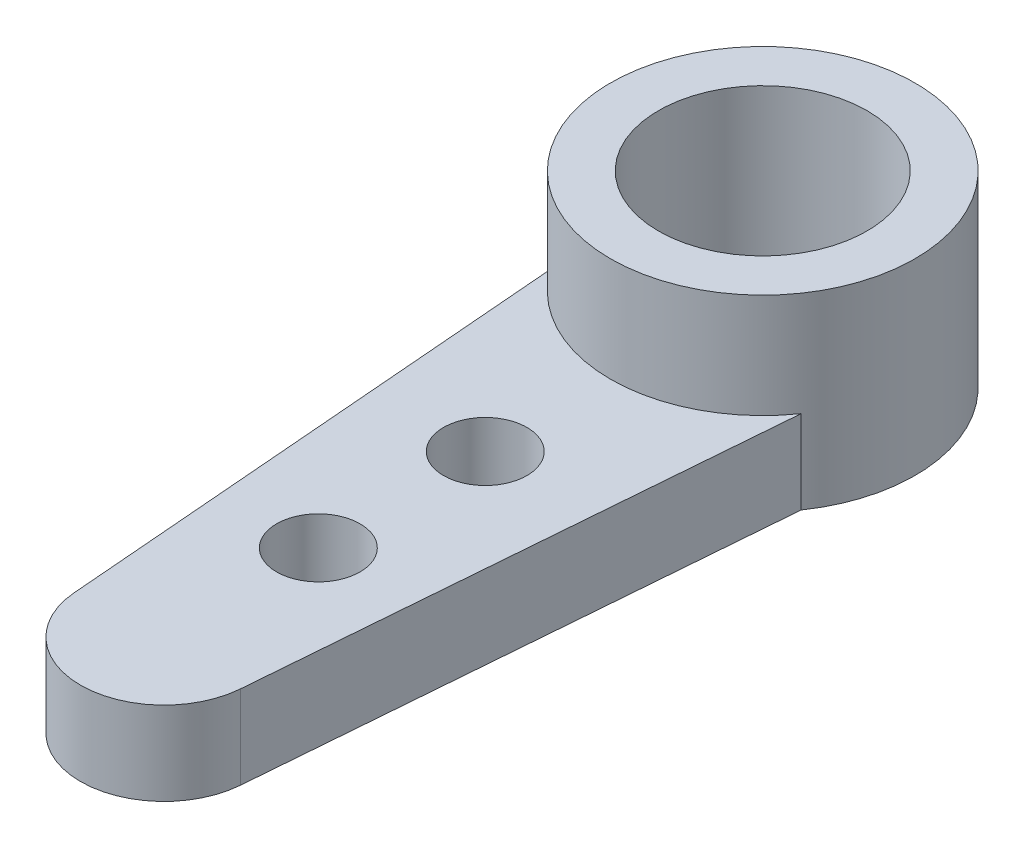
ISO-10303-21;
HEADER;
FILE_DESCRIPTION(('STEP AP214'),'2;1');
FILE_NAME('part.step','',(''),(''),'','','');
FILE_SCHEMA(('AUTOMOTIVE_DESIGN { 1 0 10303 214 1 1 1 1 }'));
ENDSEC;
DATA;
#1=APPLICATION_CONTEXT('core data for automotive mechanical design processes');
#2=APPLICATION_PROTOCOL_DEFINITION('international standard','automotive_design',2000,#1);
#3=PRODUCT_CONTEXT('',#1,'mechanical');
#4=PRODUCT('Part','Part','',(#3));
#5=PRODUCT_RELATED_PRODUCT_CATEGORY('part','',(#4));
#6=PRODUCT_DEFINITION_FORMATION('','',#4);
#7=PRODUCT_DEFINITION_CONTEXT('part definition',#1,'design');
#8=PRODUCT_DEFINITION('design','',#6,#7);
#9=PRODUCT_DEFINITION_SHAPE('','',#8);
#10=(LENGTH_UNIT() NAMED_UNIT(*) SI_UNIT(.MILLI.,.METRE.));
#11=(NAMED_UNIT(*) PLANE_ANGLE_UNIT() SI_UNIT($,.RADIAN.));
#12=(NAMED_UNIT(*) SI_UNIT($,.STERADIAN.) SOLID_ANGLE_UNIT());
#13=UNCERTAINTY_MEASURE_WITH_UNIT(LENGTH_MEASURE(1.E-05),#10,'distance_accuracy_value','');
#14=(GEOMETRIC_REPRESENTATION_CONTEXT(3) GLOBAL_UNCERTAINTY_ASSIGNED_CONTEXT((#13)) GLOBAL_UNIT_ASSIGNED_CONTEXT((#10,
#11,#12)) REPRESENTATION_CONTEXT('',''));
#15=CARTESIAN_POINT('',(0.,0.,0.));
#16=DIRECTION('',(0.,0.,1.));
#17=DIRECTION('',(1.,0.,0.));
#18=AXIS2_PLACEMENT_3D('',#15,#16,#17);
#19=CARTESIAN_POINT('',(0.,2.,0.));
#20=DIRECTION('',(0.,1.,0.));
#21=DIRECTION('',(0.,0.,1.));
#22=AXIS2_PLACEMENT_3D('',#19,#20,#21);
#23=PLANE('',#22);
#24=CARTESIAN_POINT('',(0.,2.,0.));
#25=DIRECTION('',(0.,1.,0.));
#26=DIRECTION('',(0.,0.,1.));
#27=AXIS2_PLACEMENT_3D('',#24,#25,#26);
#28=CIRCLE('',#27,3.65);
#29=CARTESIAN_POINT('',(-3.,2.,2.07906228862918));
#30=VERTEX_POINT('',#29);
#31=CARTESIAN_POINT('',(3.,2.,2.07906228862918));
#32=VERTEX_POINT('',#31);
#33=EDGE_CURVE('E11',#30,#32,#28,.T.);
#34=ORIENTED_EDGE('',*,*,#33,.F.);
#35=DIRECTION('',(0.0806960551621589,0.,0.996738755482732));
#36=VECTOR('',#35,1.);
#37=CARTESIAN_POINT('',(-1.99347751096547,2.,14.5113921103243));
#38=LINE('',#37,#36);
#39=CARTESIAN_POINT('',(-1.99347751096547,2.,14.5113921103243));
#40=VERTEX_POINT('',#39);
#41=EDGE_CURVE('E101',#30,#40,#38,.T.);
#42=ORIENTED_EDGE('',*,*,#41,.T.);
#43=CARTESIAN_POINT('',(0.,2.,14.35));
#44=DIRECTION('',(0.,1.,0.));
#45=DIRECTION('',(0.,0.,-1.));
#46=AXIS2_PLACEMENT_3D('',#43,#44,#45);
#47=CIRCLE('',#46,2.);
#48=CARTESIAN_POINT('',(1.99347751096547,2.,14.5113921103243));
#49=VERTEX_POINT('',#48);
#50=EDGE_CURVE('E52',#40,#49,#47,.T.);
#51=ORIENTED_EDGE('',*,*,#50,.T.);
#52=DIRECTION('',(0.0806960551621589,0.,-0.996738755482732));
#53=VECTOR('',#52,1.);
#54=CARTESIAN_POINT('',(3.,2.,2.07906228862918));
#55=LINE('',#54,#53);
#56=EDGE_CURVE('E83',#49,#32,#55,.T.);
#57=ORIENTED_EDGE('',*,*,#56,.T.);
#58=EDGE_LOOP('',(#34,#42,#51,#57));
#59=FACE_BOUND('',#58,.T.);
#60=CARTESIAN_POINT('',(0.,2.,10.65));
#61=DIRECTION('',(0.,1.,0.));
#62=DIRECTION('',(0.,0.,1.));
#63=AXIS2_PLACEMENT_3D('',#60,#61,#62);
#64=CIRCLE('',#63,1.);
#65=CARTESIAN_POINT('',(0.,2.,11.65));
#66=VERTEX_POINT('',#65);
#67=EDGE_CURVE('E120',#66,#66,#64,.T.);
#68=ORIENTED_EDGE('',*,*,#67,.F.);
#69=EDGE_LOOP('',(#68));
#70=FACE_BOUND('',#69,.T.);
#71=CARTESIAN_POINT('',(0.,2.,6.65));
#72=DIRECTION('',(0.,1.,0.));
#73=DIRECTION('',(0.,0.,1.));
#74=AXIS2_PLACEMENT_3D('',#71,#72,#73);
#75=CIRCLE('',#74,1.);
#76=CARTESIAN_POINT('',(0.,2.,7.65));
#77=VERTEX_POINT('',#76);
#78=EDGE_CURVE('E115',#77,#77,#75,.T.);
#79=ORIENTED_EDGE('',*,*,#78,.F.);
#80=EDGE_LOOP('',(#79));
#81=FACE_BOUND('',#80,.T.);
#82=ADVANCED_FACE('F33',(#59,#70,#81),#23,.T.);
#83=CARTESIAN_POINT('',(0.,0.,0.));
#84=DIRECTION('',(0.,1.,0.));
#85=DIRECTION('',(0.,0.,1.));
#86=AXIS2_PLACEMENT_3D('',#83,#84,#85);
#87=PLANE('',#86);
#88=CARTESIAN_POINT('',(0.,0.,10.65));
#89=DIRECTION('',(0.,1.,0.));
#90=DIRECTION('',(0.,0.,1.));
#91=AXIS2_PLACEMENT_3D('',#88,#89,#90);
#92=CIRCLE('',#91,1.);
#93=CARTESIAN_POINT('',(0.,0.,11.65));
#94=VERTEX_POINT('',#93);
#95=EDGE_CURVE('E123',#94,#94,#92,.T.);
#96=ORIENTED_EDGE('',*,*,#95,.T.);
#97=EDGE_LOOP('',(#96));
#98=FACE_BOUND('',#97,.T.);
#99=CARTESIAN_POINT('',(0.,0.,0.));
#100=DIRECTION('',(0.,1.,0.));
#101=DIRECTION('',(0.,0.,1.));
#102=AXIS2_PLACEMENT_3D('',#99,#100,#101);
#103=CIRCLE('',#102,3.65);
#104=CARTESIAN_POINT('',(3.,0.,2.07906228862918));
#105=VERTEX_POINT('',#104);
#106=CARTESIAN_POINT('',(-3.,0.,2.07906228862918));
#107=VERTEX_POINT('',#106);
#108=EDGE_CURVE('E94',#105,#107,#103,.T.);
#109=ORIENTED_EDGE('',*,*,#108,.F.);
#110=DIRECTION('',(0.0806960551621589,0.,-0.996738755482732));
#111=VECTOR('',#110,1.);
#112=CARTESIAN_POINT('',(3.,0.,2.07906228862918));
#113=LINE('',#112,#111);
#114=CARTESIAN_POINT('',(1.99347751096547,0.,14.5113921103243));
#115=VERTEX_POINT('',#114);
#116=EDGE_CURVE('E75',#115,#105,#113,.T.);
#117=ORIENTED_EDGE('',*,*,#116,.F.);
#118=CARTESIAN_POINT('',(0.,0.,14.35));
#119=DIRECTION('',(0.,1.,0.));
#120=DIRECTION('',(0.,0.,-1.));
#121=AXIS2_PLACEMENT_3D('',#118,#119,#120);
#122=CIRCLE('',#121,2.);
#123=CARTESIAN_POINT('',(-1.99347751096547,0.,14.5113921103243));
#124=VERTEX_POINT('',#123);
#125=EDGE_CURVE('E69',#124,#115,#122,.T.);
#126=ORIENTED_EDGE('',*,*,#125,.F.);
#127=DIRECTION('',(0.0806960551621589,0.,0.996738755482732));
#128=VECTOR('',#127,1.);
#129=CARTESIAN_POINT('',(-1.99347751096547,0.,14.5113921103243));
#130=LINE('',#129,#128);
#131=EDGE_CURVE('E112',#107,#124,#130,.T.);
#132=ORIENTED_EDGE('',*,*,#131,.F.);
#133=EDGE_LOOP('',(#109,#117,#126,#132));
#134=FACE_BOUND('',#133,.T.);
#135=CARTESIAN_POINT('',(0.,0.,6.65));
#136=DIRECTION('',(0.,1.,0.));
#137=DIRECTION('',(0.,0.,1.));
#138=AXIS2_PLACEMENT_3D('',#135,#136,#137);
#139=CIRCLE('',#138,1.);
#140=CARTESIAN_POINT('',(0.,0.,7.65));
#141=VERTEX_POINT('',#140);
#142=EDGE_CURVE('E117',#141,#141,#139,.T.);
#143=ORIENTED_EDGE('',*,*,#142,.T.);
#144=EDGE_LOOP('',(#143));
#145=FACE_BOUND('',#144,.T.);
#146=CARTESIAN_POINT('',(0.,0.,0.));
#147=DIRECTION('',(0.,1.,0.));
#148=DIRECTION('',(0.,0.,1.));
#149=AXIS2_PLACEMENT_3D('',#146,#147,#148);
#150=CIRCLE('',#149,2.5);
#151=CARTESIAN_POINT('',(0.,0.,2.5));
#152=VERTEX_POINT('',#151);
#153=EDGE_CURVE('E126',#152,#152,#150,.T.);
#154=ORIENTED_EDGE('',*,*,#153,.T.);
#155=EDGE_LOOP('',(#154));
#156=FACE_BOUND('',#155,.T.);
#157=ADVANCED_FACE('F151',(#98,#134,#145,#156),#87,.F.);
#158=CARTESIAN_POINT('',(0.,2.,0.));
#159=DIRECTION('',(0.,-1.,0.));
#160=DIRECTION('',(0.,0.,-1.));
#161=AXIS2_PLACEMENT_3D('',#158,#159,#160);
#162=CYLINDRICAL_SURFACE('',#161,3.65);
#163=ORIENTED_EDGE('',*,*,#108,.T.);
#164=DIRECTION('',(0.,-1.,0.));
#165=VECTOR('',#164,1.);
#166=CARTESIAN_POINT('',(-3.,2.,2.07906228862918));
#167=LINE('',#166,#165);
#168=EDGE_CURVE('E43',#30,#107,#167,.T.);
#169=ORIENTED_EDGE('',*,*,#168,.F.);
#170=ORIENTED_EDGE('',*,*,#33,.T.);
#171=DIRECTION('',(0.,-1.,0.));
#172=VECTOR('',#171,1.);
#173=CARTESIAN_POINT('',(3.,2.,2.07906228862918));
#174=LINE('',#173,#172);
#175=EDGE_CURVE('E81',#32,#105,#174,.T.);
#176=ORIENTED_EDGE('',*,*,#175,.T.);
#177=EDGE_LOOP('',(#163,#169,#170,#176));
#178=FACE_BOUND('',#177,.T.);
#179=CARTESIAN_POINT('',(0.,4.5,0.));
#180=DIRECTION('',(0.,1.,0.));
#181=DIRECTION('',(0.,0.,1.));
#182=AXIS2_PLACEMENT_3D('',#179,#180,#181);
#183=CIRCLE('',#182,3.65);
#184=CARTESIAN_POINT('',(0.,4.5,3.65));
#185=VERTEX_POINT('',#184);
#186=EDGE_CURVE('E131',#185,#185,#183,.T.);
#187=ORIENTED_EDGE('',*,*,#186,.F.);
#188=EDGE_LOOP('',(#187));
#189=FACE_BOUND('',#188,.T.);
#190=ADVANCED_FACE('F35',(#178,#189),#162,.T.);
#191=CARTESIAN_POINT('',(-1.99347751096547,2.,14.5113921103243));
#192=DIRECTION('',(0.996738755482732,0.,-0.0806960551621589));
#193=DIRECTION('',(-0.0806960551621589,0.,-0.996738755482732));
#194=AXIS2_PLACEMENT_3D('',#191,#192,#193);
#195=PLANE('',#194);
#196=ORIENTED_EDGE('',*,*,#131,.T.);
#197=DIRECTION('',(0.,-1.,0.));
#198=VECTOR('',#197,1.);
#199=CARTESIAN_POINT('',(-1.99347751096547,2.,14.5113921103243));
#200=LINE('',#199,#198);
#201=EDGE_CURVE('E96',#40,#124,#200,.T.);
#202=ORIENTED_EDGE('',*,*,#201,.F.);
#203=ORIENTED_EDGE('',*,*,#41,.F.);
#204=ORIENTED_EDGE('',*,*,#168,.T.);
#205=EDGE_LOOP('',(#196,#202,#203,#204));
#206=FACE_BOUND('',#205,.T.);
#207=ADVANCED_FACE('F166',(#206),#195,.F.);
#208=CARTESIAN_POINT('',(0.,2.,14.35));
#209=DIRECTION('',(0.,-1.,0.));
#210=DIRECTION('',(0.,0.,-1.));
#211=AXIS2_PLACEMENT_3D('',#208,#209,#210);
#212=CYLINDRICAL_SURFACE('',#211,2.);
#213=ORIENTED_EDGE('',*,*,#125,.T.);
#214=DIRECTION('',(0.,-1.,0.));
#215=VECTOR('',#214,1.);
#216=CARTESIAN_POINT('',(1.99347751096547,2.,14.5113921103243));
#217=LINE('',#216,#215);
#218=EDGE_CURVE('E87',#49,#115,#217,.T.);
#219=ORIENTED_EDGE('',*,*,#218,.F.);
#220=ORIENTED_EDGE('',*,*,#50,.F.);
#221=ORIENTED_EDGE('',*,*,#201,.T.);
#222=EDGE_LOOP('',(#213,#219,#220,#221));
#223=FACE_BOUND('',#222,.T.);
#224=ADVANCED_FACE('F164',(#223),#212,.T.);
#225=CARTESIAN_POINT('',(3.,2.,2.07906228862918));
#226=DIRECTION('',(-0.996738755482732,0.,-0.0806960551621589));
#227=DIRECTION('',(-0.0806960551621589,0.,0.996738755482732));
#228=AXIS2_PLACEMENT_3D('',#225,#226,#227);
#229=PLANE('',#228);
#230=ORIENTED_EDGE('',*,*,#116,.T.);
#231=ORIENTED_EDGE('',*,*,#175,.F.);
#232=ORIENTED_EDGE('',*,*,#56,.F.);
#233=ORIENTED_EDGE('',*,*,#218,.T.);
#234=EDGE_LOOP('',(#230,#231,#232,#233));
#235=FACE_BOUND('',#234,.T.);
#236=ADVANCED_FACE('F82',(#235),#229,.F.);
#237=CARTESIAN_POINT('',(0.,2.,6.65));
#238=DIRECTION('',(0.,-1.,0.));
#239=DIRECTION('',(0.,0.,-1.));
#240=AXIS2_PLACEMENT_3D('',#237,#238,#239);
#241=CYLINDRICAL_SURFACE('',#240,1.);
#242=ORIENTED_EDGE('',*,*,#78,.T.);
#243=EDGE_LOOP('',(#242));
#244=FACE_BOUND('',#243,.T.);
#245=ORIENTED_EDGE('',*,*,#142,.F.);
#246=EDGE_LOOP('',(#245));
#247=FACE_BOUND('',#246,.T.);
#248=ADVANCED_FACE('F159',(#244,#247),#241,.F.);
#249=CARTESIAN_POINT('',(0.,2.,10.65));
#250=DIRECTION('',(0.,-1.,0.));
#251=DIRECTION('',(0.,0.,-1.));
#252=AXIS2_PLACEMENT_3D('',#249,#250,#251);
#253=CYLINDRICAL_SURFACE('',#252,1.);
#254=ORIENTED_EDGE('',*,*,#67,.T.);
#255=EDGE_LOOP('',(#254));
#256=FACE_BOUND('',#255,.T.);
#257=ORIENTED_EDGE('',*,*,#95,.F.);
#258=EDGE_LOOP('',(#257));
#259=FACE_BOUND('',#258,.T.);
#260=ADVANCED_FACE('F147',(#256,#259),#253,.F.);
#261=CARTESIAN_POINT('',(0.,2.,0.));
#262=DIRECTION('',(0.,-1.,0.));
#263=DIRECTION('',(0.,0.,-1.));
#264=AXIS2_PLACEMENT_3D('',#261,#262,#263);
#265=CYLINDRICAL_SURFACE('',#264,2.5);
#266=ORIENTED_EDGE('',*,*,#153,.F.);
#267=EDGE_LOOP('',(#266));
#268=FACE_BOUND('',#267,.T.);
#269=CARTESIAN_POINT('',(0.,4.5,0.));
#270=DIRECTION('',(0.,1.,0.));
#271=DIRECTION('',(0.,0.,1.));
#272=AXIS2_PLACEMENT_3D('',#269,#270,#271);
#273=CIRCLE('',#272,2.5);
#274=CARTESIAN_POINT('',(0.,4.5,2.5));
#275=VERTEX_POINT('',#274);
#276=EDGE_CURVE('E134',#275,#275,#273,.T.);
#277=ORIENTED_EDGE('',*,*,#276,.T.);
#278=EDGE_LOOP('',(#277));
#279=FACE_BOUND('',#278,.T.);
#280=ADVANCED_FACE('F138',(#268,#279),#265,.F.);
#281=CARTESIAN_POINT('',(0.,4.5,0.));
#282=DIRECTION('',(0.,1.,0.));
#283=DIRECTION('',(0.,0.,1.));
#284=AXIS2_PLACEMENT_3D('',#281,#282,#283);
#285=PLANE('',#284);
#286=ORIENTED_EDGE('',*,*,#186,.T.);
#287=EDGE_LOOP('',(#286));
#288=FACE_BOUND('',#287,.T.);
#289=ORIENTED_EDGE('',*,*,#276,.F.);
#290=EDGE_LOOP('',(#289));
#291=FACE_BOUND('',#290,.T.);
#292=ADVANCED_FACE('F140',(#288,#291),#285,.T.);
#293=CLOSED_SHELL('',(#82,#157,#190,#207,#224,#236,#248,#260,#280,#292));
#294=MANIFOLD_SOLID_BREP('B2',#293);
#295=ADVANCED_BREP_SHAPE_REPRESENTATION('',(#18,#294),#14);
#296=SHAPE_DEFINITION_REPRESENTATION(#9,#295);
ENDSEC;
END-ISO-10303-21;
